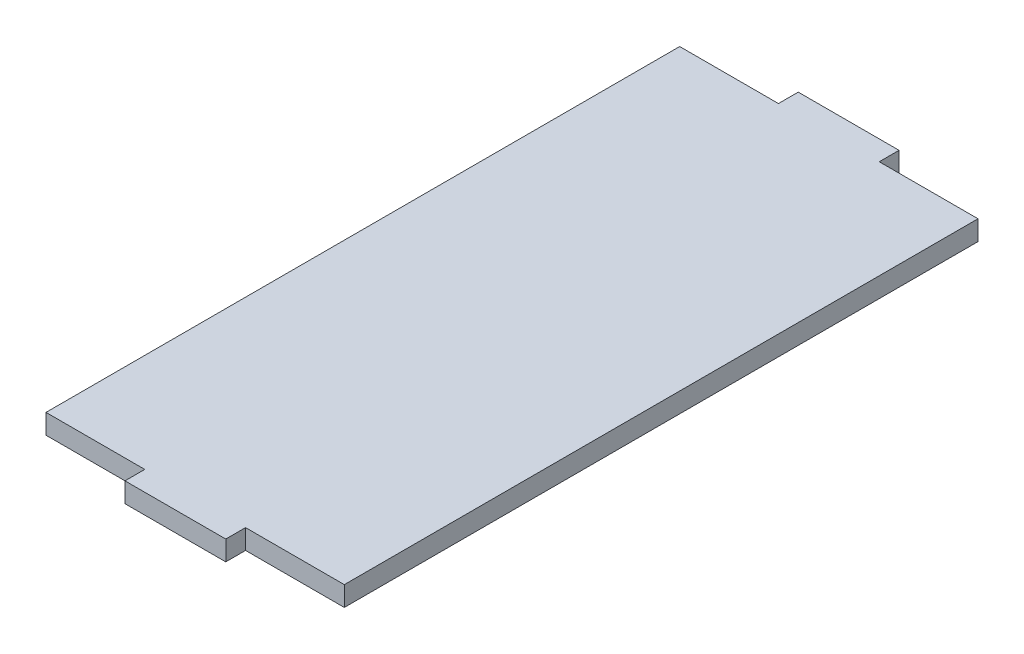
ISO-10303-21;
HEADER;
FILE_DESCRIPTION(('STEP AP214'),'2;1');
FILE_NAME('part.step','',(''),(''),'','','');
FILE_SCHEMA(('AUTOMOTIVE_DESIGN { 1 0 10303 214 1 1 1 1 }'));
ENDSEC;
DATA;
#1=APPLICATION_CONTEXT('core data for automotive mechanical design processes');
#2=APPLICATION_PROTOCOL_DEFINITION('international standard','automotive_design',2000,#1);
#3=PRODUCT_CONTEXT('',#1,'mechanical');
#4=PRODUCT('Part','Part','',(#3));
#5=PRODUCT_RELATED_PRODUCT_CATEGORY('part','',(#4));
#6=PRODUCT_DEFINITION_FORMATION('','',#4);
#7=PRODUCT_DEFINITION_CONTEXT('part definition',#1,'design');
#8=PRODUCT_DEFINITION('design','',#6,#7);
#9=PRODUCT_DEFINITION_SHAPE('','',#8);
#10=(LENGTH_UNIT() NAMED_UNIT(*) SI_UNIT(.MILLI.,.METRE.));
#11=(NAMED_UNIT(*) PLANE_ANGLE_UNIT() SI_UNIT($,.RADIAN.));
#12=(NAMED_UNIT(*) SI_UNIT($,.STERADIAN.) SOLID_ANGLE_UNIT());
#13=UNCERTAINTY_MEASURE_WITH_UNIT(LENGTH_MEASURE(1.E-05),#10,'distance_accuracy_value','');
#14=(GEOMETRIC_REPRESENTATION_CONTEXT(3) GLOBAL_UNCERTAINTY_ASSIGNED_CONTEXT((#13)) GLOBAL_UNIT_ASSIGNED_CONTEXT((#10,
#11,#12)) REPRESENTATION_CONTEXT('',''));
#15=CARTESIAN_POINT('',(0.,0.,0.));
#16=DIRECTION('',(0.,0.,1.));
#17=DIRECTION('',(1.,0.,0.));
#18=AXIS2_PLACEMENT_3D('',#15,#16,#17);
#19=CARTESIAN_POINT('',(-17.8911926131899,3.175,31.7071691311531));
#20=DIRECTION('',(0.,0.,-1.));
#21=DIRECTION('',(-1.,0.,0.));
#22=AXIS2_PLACEMENT_3D('',#19,#20,#21);
#23=PLANE('',#22);
#24=DIRECTION('',(0.,1.,0.));
#25=VECTOR('',#24,1.);
#26=CARTESIAN_POINT('',(14.1038073868101,-16.4689472948334,31.7071691311531));
#27=LINE('',#26,#25);
#28=CARTESIAN_POINT('',(14.1038073868101,0.,31.7071691311531));
#29=VERTEX_POINT('',#28);
#30=CARTESIAN_POINT('',(14.1038073868101,3.175,31.7071691311531));
#31=VERTEX_POINT('',#30);
#32=EDGE_CURVE('E56',#29,#31,#27,.T.);
#33=ORIENTED_EDGE('',*,*,#32,.F.);
#34=DIRECTION('',(1.,0.,0.));
#35=VECTOR('',#34,1.);
#36=CARTESIAN_POINT('',(-17.8911926131899,0.,31.7071691311531));
#37=LINE('',#36,#35);
#38=CARTESIAN_POINT('',(29.9388073868101,0.,31.7071691311531));
#39=VERTEX_POINT('',#38);
#40=EDGE_CURVE('E197',#29,#39,#37,.T.);
#41=ORIENTED_EDGE('',*,*,#40,.T.);
#42=DIRECTION('',(0.,-1.,0.));
#43=VECTOR('',#42,1.);
#44=CARTESIAN_POINT('',(29.9388073868101,3.175,31.7071691311531));
#45=LINE('',#44,#43);
#46=CARTESIAN_POINT('',(29.9388073868101,3.175,31.7071691311531));
#47=VERTEX_POINT('',#46);
#48=EDGE_CURVE('E41',#47,#39,#45,.T.);
#49=ORIENTED_EDGE('',*,*,#48,.F.);
#50=DIRECTION('',(1.,0.,0.));
#51=VECTOR('',#50,1.);
#52=CARTESIAN_POINT('',(-17.8911926131899,3.175,31.7071691311531));
#53=LINE('',#52,#51);
#54=EDGE_CURVE('E185',#31,#47,#53,.T.);
#55=ORIENTED_EDGE('',*,*,#54,.F.);
#56=EDGE_LOOP('',(#33,#41,#49,#55));
#57=FACE_BOUND('',#56,.T.);
#58=ADVANCED_FACE('F33',(#57),#23,.F.);
#59=CARTESIAN_POINT('',(-17.8911926131899,3.175,-69.8928308688469));
#60=DIRECTION('',(0.,0.,1.));
#61=DIRECTION('',(1.,0.,0.));
#62=AXIS2_PLACEMENT_3D('',#59,#60,#61);
#63=PLANE('',#62);
#64=DIRECTION('',(0.,1.,0.));
#65=VECTOR('',#64,1.);
#66=CARTESIAN_POINT('',(-2.05619261318988,-16.4689472948334,-69.8928308688469));
#67=LINE('',#66,#65);
#68=CARTESIAN_POINT('',(-2.05619261318988,0.,-69.8928308688469));
#69=VERTEX_POINT('',#68);
#70=CARTESIAN_POINT('',(-2.05619261318988,3.175,-69.8928308688469));
#71=VERTEX_POINT('',#70);
#72=EDGE_CURVE('E175',#69,#71,#67,.T.);
#73=ORIENTED_EDGE('',*,*,#72,.F.);
#74=DIRECTION('',(-1.,0.,0.));
#75=VECTOR('',#74,1.);
#76=CARTESIAN_POINT('',(-17.8911926131899,0.,-69.8928308688469));
#77=LINE('',#76,#75);
#78=CARTESIAN_POINT('',(-17.8911926131899,0.,-69.8928308688469));
#79=VERTEX_POINT('',#78);
#80=EDGE_CURVE('E202',#69,#79,#77,.T.);
#81=ORIENTED_EDGE('',*,*,#80,.T.);
#82=DIRECTION('',(0.,-1.,0.));
#83=VECTOR('',#82,1.);
#84=CARTESIAN_POINT('',(-17.8911926131899,3.175,-69.8928308688469));
#85=LINE('',#84,#83);
#86=CARTESIAN_POINT('',(-17.8911926131899,3.175,-69.8928308688469));
#87=VERTEX_POINT('',#86);
#88=EDGE_CURVE('E194',#87,#79,#85,.T.);
#89=ORIENTED_EDGE('',*,*,#88,.F.);
#90=DIRECTION('',(-1.,0.,0.));
#91=VECTOR('',#90,1.);
#92=CARTESIAN_POINT('',(-17.8911926131899,3.175,-69.8928308688469));
#93=LINE('',#92,#91);
#94=EDGE_CURVE('E190',#71,#87,#93,.T.);
#95=ORIENTED_EDGE('',*,*,#94,.F.);
#96=EDGE_LOOP('',(#73,#81,#89,#95));
#97=FACE_BOUND('',#96,.T.);
#98=ADVANCED_FACE('F241',(#97),#63,.F.);
#99=CARTESIAN_POINT('',(-17.8911926131899,3.175,-69.8928308688469));
#100=DIRECTION('',(1.,0.,0.));
#101=DIRECTION('',(0.,0.,-1.));
#102=AXIS2_PLACEMENT_3D('',#99,#100,#101);
#103=PLANE('',#102);
#104=DIRECTION('',(0.,0.,1.));
#105=VECTOR('',#104,1.);
#106=CARTESIAN_POINT('',(-17.8911926131899,0.,-69.8928308688469));
#107=LINE('',#106,#105);
#108=CARTESIAN_POINT('',(-17.8911926131899,0.,31.7071691311531));
#109=VERTEX_POINT('',#108);
#110=EDGE_CURVE('E166',#79,#109,#107,.T.);
#111=ORIENTED_EDGE('',*,*,#110,.T.);
#112=DIRECTION('',(0.,-1.,0.));
#113=VECTOR('',#112,1.);
#114=CARTESIAN_POINT('',(-17.8911926131899,3.175,31.7071691311531));
#115=LINE('',#114,#113);
#116=CARTESIAN_POINT('',(-17.8911926131899,3.175,31.7071691311531));
#117=VERTEX_POINT('',#116);
#118=EDGE_CURVE('E11',#117,#109,#115,.T.);
#119=ORIENTED_EDGE('',*,*,#118,.F.);
#120=DIRECTION('',(0.,0.,1.));
#121=VECTOR('',#120,1.);
#122=CARTESIAN_POINT('',(-17.8911926131899,3.175,-69.8928308688469));
#123=LINE('',#122,#121);
#124=EDGE_CURVE('E183',#87,#117,#123,.T.);
#125=ORIENTED_EDGE('',*,*,#124,.F.);
#126=ORIENTED_EDGE('',*,*,#88,.T.);
#127=EDGE_LOOP('',(#111,#119,#125,#126));
#128=FACE_BOUND('',#127,.T.);
#129=ADVANCED_FACE('F35',(#128),#103,.F.);
#130=CARTESIAN_POINT('',(-2.05619261318985,0.,31.7071691311531));
#131=VERTEX_POINT('',#130);
#132=EDGE_CURVE('E198',#109,#131,#37,.T.);
#133=ORIENTED_EDGE('',*,*,#132,.T.);
#134=DIRECTION('',(0.,1.,0.));
#135=VECTOR('',#134,1.);
#136=CARTESIAN_POINT('',(-2.05619261318985,-16.4689472948334,31.7071691311531));
#137=LINE('',#136,#135);
#138=CARTESIAN_POINT('',(-2.05619261318985,3.175,31.7071691311531));
#139=VERTEX_POINT('',#138);
#140=EDGE_CURVE('E48',#131,#139,#137,.T.);
#141=ORIENTED_EDGE('',*,*,#140,.T.);
#142=EDGE_CURVE('E145',#117,#139,#53,.T.);
#143=ORIENTED_EDGE('',*,*,#142,.F.);
#144=ORIENTED_EDGE('',*,*,#118,.T.);
#145=EDGE_LOOP('',(#133,#141,#143,#144));
#146=FACE_BOUND('',#145,.T.);
#147=ADVANCED_FACE('F245',(#146),#23,.F.);
#148=CARTESIAN_POINT('',(29.9388073868101,3.175,-69.8928308688469));
#149=DIRECTION('',(-1.,0.,0.));
#150=DIRECTION('',(0.,0.,1.));
#151=AXIS2_PLACEMENT_3D('',#148,#149,#150);
#152=PLANE('',#151);
#153=DIRECTION('',(0.,0.,-1.));
#154=VECTOR('',#153,1.);
#155=CARTESIAN_POINT('',(29.9388073868101,0.,-69.8928308688469));
#156=LINE('',#155,#154);
#157=CARTESIAN_POINT('',(29.9388073868101,0.,-69.8928308688469));
#158=VERTEX_POINT('',#157);
#159=EDGE_CURVE('E200',#39,#158,#156,.T.);
#160=ORIENTED_EDGE('',*,*,#159,.T.);
#161=DIRECTION('',(0.,-1.,0.));
#162=VECTOR('',#161,1.);
#163=CARTESIAN_POINT('',(29.9388073868101,3.175,-69.8928308688469));
#164=LINE('',#163,#162);
#165=CARTESIAN_POINT('',(29.9388073868101,3.175,-69.8928308688469));
#166=VERTEX_POINT('',#165);
#167=EDGE_CURVE('E206',#166,#158,#164,.T.);
#168=ORIENTED_EDGE('',*,*,#167,.F.);
#169=DIRECTION('',(0.,0.,-1.));
#170=VECTOR('',#169,1.);
#171=CARTESIAN_POINT('',(29.9388073868101,3.175,-69.8928308688469));
#172=LINE('',#171,#170);
#173=EDGE_CURVE('E188',#47,#166,#172,.T.);
#174=ORIENTED_EDGE('',*,*,#173,.F.);
#175=ORIENTED_EDGE('',*,*,#48,.T.);
#176=EDGE_LOOP('',(#160,#168,#174,#175));
#177=FACE_BOUND('',#176,.T.);
#178=ADVANCED_FACE('F213',(#177),#152,.F.);
#179=CARTESIAN_POINT('',(14.1038073868101,0.,-69.8928308688469));
#180=VERTEX_POINT('',#179);
#181=EDGE_CURVE('E186',#158,#180,#77,.T.);
#182=ORIENTED_EDGE('',*,*,#181,.T.);
#183=DIRECTION('',(0.,1.,0.));
#184=VECTOR('',#183,1.);
#185=CARTESIAN_POINT('',(14.1038073868101,-16.4689472948334,-69.8928308688469));
#186=LINE('',#185,#184);
#187=CARTESIAN_POINT('',(14.1038073868101,3.175,-69.8928308688469));
#188=VERTEX_POINT('',#187);
#189=EDGE_CURVE('E179',#180,#188,#186,.T.);
#190=ORIENTED_EDGE('',*,*,#189,.T.);
#191=EDGE_CURVE('E191',#166,#188,#93,.T.);
#192=ORIENTED_EDGE('',*,*,#191,.F.);
#193=ORIENTED_EDGE('',*,*,#167,.T.);
#194=EDGE_LOOP('',(#182,#190,#192,#193));
#195=FACE_BOUND('',#194,.T.);
#196=ADVANCED_FACE('F223',(#195),#63,.F.);
#197=CARTESIAN_POINT('',(0.,3.175,0.));
#198=DIRECTION('',(0.,1.,0.));
#199=DIRECTION('',(0.,0.,1.));
#200=AXIS2_PLACEMENT_3D('',#197,#198,#199);
#201=PLANE('',#200);
#202=ORIENTED_EDGE('',*,*,#124,.T.);
#203=ORIENTED_EDGE('',*,*,#142,.T.);
#204=DIRECTION('',(0.,0.,1.));
#205=VECTOR('',#204,1.);
#206=CARTESIAN_POINT('',(-2.05619261318985,3.175,31.7071691311531));
#207=LINE('',#206,#205);
#208=CARTESIAN_POINT('',(-2.05619261318987,3.175,34.8821691311531));
#209=VERTEX_POINT('',#208);
#210=EDGE_CURVE('E127',#139,#209,#207,.T.);
#211=ORIENTED_EDGE('',*,*,#210,.T.);
#212=DIRECTION('',(1.,0.,0.));
#213=VECTOR('',#212,1.);
#214=CARTESIAN_POINT('',(-2.05619261318987,3.175,34.8821691311531));
#215=LINE('',#214,#213);
#216=CARTESIAN_POINT('',(14.1038073868102,3.175,34.8821691311531));
#217=VERTEX_POINT('',#216);
#218=EDGE_CURVE('E135',#209,#217,#215,.T.);
#219=ORIENTED_EDGE('',*,*,#218,.T.);
#220=DIRECTION('',(0.,0.,-1.));
#221=VECTOR('',#220,1.);
#222=CARTESIAN_POINT('',(14.1038073868101,3.175,31.7071691311531));
#223=LINE('',#222,#221);
#224=EDGE_CURVE('E141',#217,#31,#223,.T.);
#225=ORIENTED_EDGE('',*,*,#224,.T.);
#226=ORIENTED_EDGE('',*,*,#54,.T.);
#227=ORIENTED_EDGE('',*,*,#173,.T.);
#228=ORIENTED_EDGE('',*,*,#191,.T.);
#229=DIRECTION('',(0.,0.,-1.));
#230=VECTOR('',#229,1.);
#231=CARTESIAN_POINT('',(14.1038073868101,3.175,-69.8928308688469));
#232=LINE('',#231,#230);
#233=CARTESIAN_POINT('',(14.1038073868101,3.175,-73.0678308688469));
#234=VERTEX_POINT('',#233);
#235=EDGE_CURVE('E169',#188,#234,#232,.T.);
#236=ORIENTED_EDGE('',*,*,#235,.T.);
#237=DIRECTION('',(-1.,0.,0.));
#238=VECTOR('',#237,1.);
#239=CARTESIAN_POINT('',(-2.05619261318987,3.175,-73.0678308688469));
#240=LINE('',#239,#238);
#241=CARTESIAN_POINT('',(-2.05619261318987,3.175,-73.0678308688469));
#242=VERTEX_POINT('',#241);
#243=EDGE_CURVE('E172',#234,#242,#240,.T.);
#244=ORIENTED_EDGE('',*,*,#243,.T.);
#245=DIRECTION('',(0.,0.,1.));
#246=VECTOR('',#245,1.);
#247=CARTESIAN_POINT('',(-2.05619261318988,3.175,-69.8928308688469));
#248=LINE('',#247,#246);
#249=EDGE_CURVE('E157',#242,#71,#248,.T.);
#250=ORIENTED_EDGE('',*,*,#249,.T.);
#251=ORIENTED_EDGE('',*,*,#94,.T.);
#252=EDGE_LOOP('',(#202,#203,#211,#219,#225,#226,#227,#228,#236,#244,#250,#251));
#253=FACE_BOUND('',#252,.T.);
#254=ADVANCED_FACE('F144',(#253),#201,.T.);
#255=CARTESIAN_POINT('',(0.,0.,0.));
#256=DIRECTION('',(0.,1.,0.));
#257=DIRECTION('',(0.,0.,1.));
#258=AXIS2_PLACEMENT_3D('',#255,#256,#257);
#259=PLANE('',#258);
#260=ORIENTED_EDGE('',*,*,#110,.F.);
#261=ORIENTED_EDGE('',*,*,#80,.F.);
#262=DIRECTION('',(0.,0.,-1.));
#263=VECTOR('',#262,1.);
#264=CARTESIAN_POINT('',(-2.05619261318988,0.,-69.8928308688469));
#265=LINE('',#264,#263);
#266=CARTESIAN_POINT('',(-2.05619261318987,0.,-73.0678308688469));
#267=VERTEX_POINT('',#266);
#268=EDGE_CURVE('E164',#69,#267,#265,.T.);
#269=ORIENTED_EDGE('',*,*,#268,.T.);
#270=DIRECTION('',(1.,0.,0.));
#271=VECTOR('',#270,1.);
#272=CARTESIAN_POINT('',(-2.05619261318987,0.,-73.0678308688469));
#273=LINE('',#272,#271);
#274=CARTESIAN_POINT('',(14.1038073868101,0.,-73.0678308688469));
#275=VERTEX_POINT('',#274);
#276=EDGE_CURVE('E161',#267,#275,#273,.T.);
#277=ORIENTED_EDGE('',*,*,#276,.T.);
#278=DIRECTION('',(0.,0.,1.));
#279=VECTOR('',#278,1.);
#280=CARTESIAN_POINT('',(14.1038073868101,0.,-69.8928308688469));
#281=LINE('',#280,#279);
#282=EDGE_CURVE('E158',#275,#180,#281,.T.);
#283=ORIENTED_EDGE('',*,*,#282,.T.);
#284=ORIENTED_EDGE('',*,*,#181,.F.);
#285=ORIENTED_EDGE('',*,*,#159,.F.);
#286=ORIENTED_EDGE('',*,*,#40,.F.);
#287=DIRECTION('',(0.,0.,1.));
#288=VECTOR('',#287,1.);
#289=CARTESIAN_POINT('',(14.1038073868101,0.,31.7071691311531));
#290=LINE('',#289,#288);
#291=CARTESIAN_POINT('',(14.1038073868101,0.,34.8821691311531));
#292=VERTEX_POINT('',#291);
#293=EDGE_CURVE('E148',#29,#292,#290,.T.);
#294=ORIENTED_EDGE('',*,*,#293,.T.);
#295=DIRECTION('',(-1.,0.,0.));
#296=VECTOR('',#295,1.);
#297=CARTESIAN_POINT('',(-2.05619261318987,0.,34.8821691311531));
#298=LINE('',#297,#296);
#299=CARTESIAN_POINT('',(-2.05619261318987,0.,34.8821691311531));
#300=VERTEX_POINT('',#299);
#301=EDGE_CURVE('E153',#292,#300,#298,.T.);
#302=ORIENTED_EDGE('',*,*,#301,.T.);
#303=DIRECTION('',(0.,0.,-1.));
#304=VECTOR('',#303,1.);
#305=CARTESIAN_POINT('',(-2.05619261318985,0.,31.7071691311531));
#306=LINE('',#305,#304);
#307=EDGE_CURVE('E129',#300,#131,#306,.T.);
#308=ORIENTED_EDGE('',*,*,#307,.T.);
#309=ORIENTED_EDGE('',*,*,#132,.F.);
#310=EDGE_LOOP('',(#260,#261,#269,#277,#283,#284,#285,#286,#294,#302,#308,#309));
#311=FACE_BOUND('',#310,.T.);
#312=ADVANCED_FACE('F218',(#311),#259,.F.);
#313=CARTESIAN_POINT('',(-2.05619261318988,-16.4689472948334,-69.8928308688469));
#314=DIRECTION('',(-1.,0.,0.));
#315=DIRECTION('',(0.,0.,1.));
#316=AXIS2_PLACEMENT_3D('',#313,#314,#315);
#317=PLANE('',#316);
#318=ORIENTED_EDGE('',*,*,#268,.F.);
#319=ORIENTED_EDGE('',*,*,#72,.T.);
#320=ORIENTED_EDGE('',*,*,#249,.F.);
#321=DIRECTION('',(0.,1.,0.));
#322=VECTOR('',#321,1.);
#323=CARTESIAN_POINT('',(-2.05619261318987,-16.4689472948334,-73.0678308688469));
#324=LINE('',#323,#322);
#325=EDGE_CURVE('E162',#267,#242,#324,.T.);
#326=ORIENTED_EDGE('',*,*,#325,.F.);
#327=EDGE_LOOP('',(#318,#319,#320,#326));
#328=FACE_BOUND('',#327,.T.);
#329=ADVANCED_FACE('F238',(#328),#317,.T.);
#330=CARTESIAN_POINT('',(-2.05619261318987,-16.4689472948334,-73.0678308688469));
#331=DIRECTION('',(0.,0.,-1.));
#332=DIRECTION('',(-1.,0.,0.));
#333=AXIS2_PLACEMENT_3D('',#330,#331,#332);
#334=PLANE('',#333);
#335=ORIENTED_EDGE('',*,*,#276,.F.);
#336=ORIENTED_EDGE('',*,*,#325,.T.);
#337=ORIENTED_EDGE('',*,*,#243,.F.);
#338=DIRECTION('',(0.,1.,0.));
#339=VECTOR('',#338,1.);
#340=CARTESIAN_POINT('',(14.1038073868101,-16.4689472948334,-73.0678308688469));
#341=LINE('',#340,#339);
#342=EDGE_CURVE('E177',#275,#234,#341,.T.);
#343=ORIENTED_EDGE('',*,*,#342,.F.);
#344=EDGE_LOOP('',(#335,#336,#337,#343));
#345=FACE_BOUND('',#344,.T.);
#346=ADVANCED_FACE('F232',(#345),#334,.T.);
#347=CARTESIAN_POINT('',(14.1038073868101,-16.4689472948334,-69.8928308688469));
#348=DIRECTION('',(1.,0.,0.));
#349=DIRECTION('',(0.,0.,-1.));
#350=AXIS2_PLACEMENT_3D('',#347,#348,#349);
#351=PLANE('',#350);
#352=ORIENTED_EDGE('',*,*,#282,.F.);
#353=ORIENTED_EDGE('',*,*,#342,.T.);
#354=ORIENTED_EDGE('',*,*,#235,.F.);
#355=ORIENTED_EDGE('',*,*,#189,.F.);
#356=EDGE_LOOP('',(#352,#353,#354,#355));
#357=FACE_BOUND('',#356,.T.);
#358=ADVANCED_FACE('F228',(#357),#351,.T.);
#359=CARTESIAN_POINT('',(14.1038073868101,-16.4689472948334,31.7071691311531));
#360=DIRECTION('',(1.,0.,0.));
#361=DIRECTION('',(0.,0.,-1.));
#362=AXIS2_PLACEMENT_3D('',#359,#360,#361);
#363=PLANE('',#362);
#364=ORIENTED_EDGE('',*,*,#293,.F.);
#365=ORIENTED_EDGE('',*,*,#32,.T.);
#366=ORIENTED_EDGE('',*,*,#224,.F.);
#367=DIRECTION('',(0.,1.,0.));
#368=VECTOR('',#367,1.);
#369=CARTESIAN_POINT('',(14.1038073868102,-16.4689472948334,34.8821691311531));
#370=LINE('',#369,#368);
#371=EDGE_CURVE('E132',#292,#217,#370,.T.);
#372=ORIENTED_EDGE('',*,*,#371,.F.);
#373=EDGE_LOOP('',(#364,#365,#366,#372));
#374=FACE_BOUND('',#373,.T.);
#375=ADVANCED_FACE('F247',(#374),#363,.T.);
#376=CARTESIAN_POINT('',(-2.05619261318987,-16.4689472948334,34.8821691311531));
#377=DIRECTION('',(0.,0.,1.));
#378=DIRECTION('',(1.,0.,0.));
#379=AXIS2_PLACEMENT_3D('',#376,#377,#378);
#380=PLANE('',#379);
#381=ORIENTED_EDGE('',*,*,#301,.F.);
#382=ORIENTED_EDGE('',*,*,#371,.T.);
#383=ORIENTED_EDGE('',*,*,#218,.F.);
#384=DIRECTION('',(0.,1.,0.));
#385=VECTOR('',#384,1.);
#386=CARTESIAN_POINT('',(-2.05619261318987,-16.4689472948334,34.8821691311531));
#387=LINE('',#386,#385);
#388=EDGE_CURVE('E123',#300,#209,#387,.T.);
#389=ORIENTED_EDGE('',*,*,#388,.F.);
#390=EDGE_LOOP('',(#381,#382,#383,#389));
#391=FACE_BOUND('',#390,.T.);
#392=ADVANCED_FACE('F136',(#391),#380,.T.);
#393=CARTESIAN_POINT('',(-2.05619261318985,-16.4689472948334,31.7071691311531));
#394=DIRECTION('',(-1.,0.,0.));
#395=DIRECTION('',(0.,0.,1.));
#396=AXIS2_PLACEMENT_3D('',#393,#394,#395);
#397=PLANE('',#396);
#398=ORIENTED_EDGE('',*,*,#307,.F.);
#399=ORIENTED_EDGE('',*,*,#388,.T.);
#400=ORIENTED_EDGE('',*,*,#210,.F.);
#401=ORIENTED_EDGE('',*,*,#140,.F.);
#402=EDGE_LOOP('',(#398,#399,#400,#401));
#403=FACE_BOUND('',#402,.T.);
#404=ADVANCED_FACE('F125',(#403),#397,.T.);
#405=CLOSED_SHELL('',(#58,#98,#129,#147,#178,#196,#254,#312,#329,#346,#358,#375,#392,#404));
#406=MANIFOLD_SOLID_BREP('B2',#405);
#407=ADVANCED_BREP_SHAPE_REPRESENTATION('',(#18,#406),#14);
#408=SHAPE_DEFINITION_REPRESENTATION(#9,#407);
ENDSEC;
END-ISO-10303-21;
